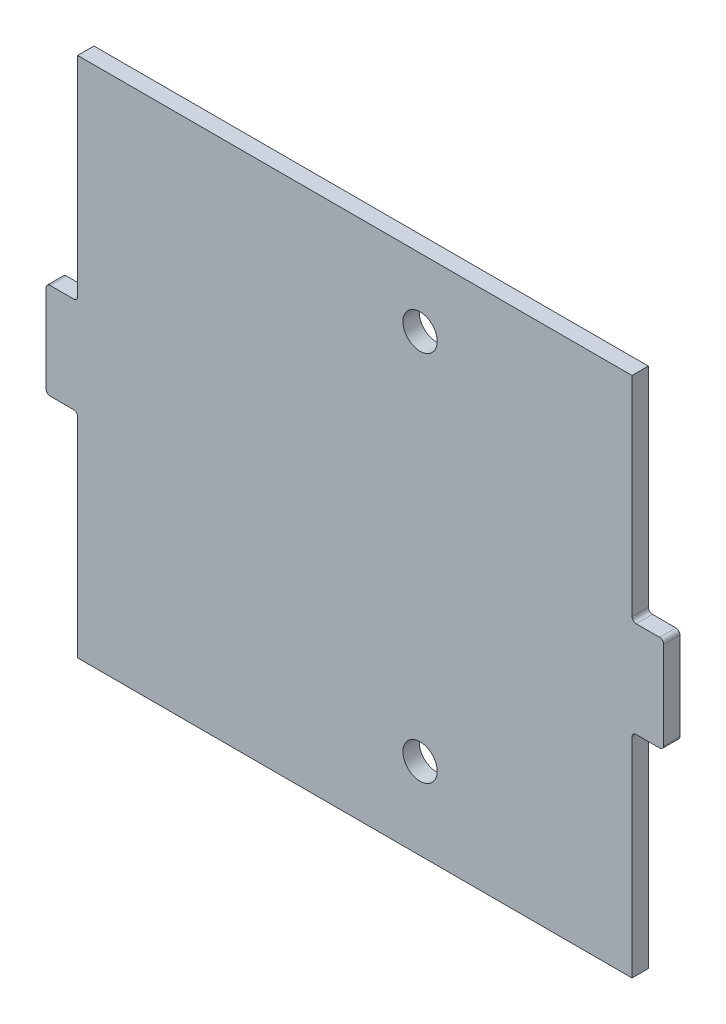
ISO-10303-21;
HEADER;
FILE_DESCRIPTION(('STEP AP214'),'2;1');
FILE_NAME('part.step','',(''),(''),'','','');
FILE_SCHEMA(('AUTOMOTIVE_DESIGN { 1 0 10303 214 1 1 1 1 }'));
ENDSEC;
DATA;
#1=APPLICATION_CONTEXT('core data for automotive mechanical design processes');
#2=APPLICATION_PROTOCOL_DEFINITION('international standard','automotive_design',2000,#1);
#3=PRODUCT_CONTEXT('',#1,'mechanical');
#4=PRODUCT('Part','Part','',(#3));
#5=PRODUCT_RELATED_PRODUCT_CATEGORY('part','',(#4));
#6=PRODUCT_DEFINITION_FORMATION('','',#4);
#7=PRODUCT_DEFINITION_CONTEXT('part definition',#1,'design');
#8=PRODUCT_DEFINITION('design','',#6,#7);
#9=PRODUCT_DEFINITION_SHAPE('','',#8);
#10=(LENGTH_UNIT() NAMED_UNIT(*) SI_UNIT(.MILLI.,.METRE.));
#11=(NAMED_UNIT(*) PLANE_ANGLE_UNIT() SI_UNIT($,.RADIAN.));
#12=(NAMED_UNIT(*) SI_UNIT($,.STERADIAN.) SOLID_ANGLE_UNIT());
#13=UNCERTAINTY_MEASURE_WITH_UNIT(LENGTH_MEASURE(1.E-05),#10,'distance_accuracy_value','');
#14=(GEOMETRIC_REPRESENTATION_CONTEXT(3) GLOBAL_UNCERTAINTY_ASSIGNED_CONTEXT((#13)) GLOBAL_UNIT_ASSIGNED_CONTEXT((#10,
#11,#12)) REPRESENTATION_CONTEXT('',''));
#15=CARTESIAN_POINT('',(0.,0.,0.));
#16=DIRECTION('',(0.,0.,1.));
#17=DIRECTION('',(1.,0.,0.));
#18=AXIS2_PLACEMENT_3D('',#15,#16,#17);
#19=CARTESIAN_POINT('',(215.9,-38.1,6.35));
#20=DIRECTION('',(-1.,0.,0.));
#21=DIRECTION('',(0.,-1.,0.));
#22=AXIS2_PLACEMENT_3D('',#19,#20,#21);
#23=PLANE('',#22);
#24=DIRECTION('',(0.,1.,0.));
#25=VECTOR('',#24,1.);
#26=CARTESIAN_POINT('',(215.9,-38.1,-6.35));
#27=LINE('',#26,#25);
#28=CARTESIAN_POINT('',(215.9,-203.2,-6.35));
#29=VERTEX_POINT('',#28);
#30=CARTESIAN_POINT('',(215.9,-40.513,-6.35));
#31=VERTEX_POINT('',#30);
#32=EDGE_CURVE('E202',#29,#31,#27,.T.);
#33=ORIENTED_EDGE('',*,*,#32,.T.);
#34=DIRECTION('',(0.,0.,-1.));
#35=VECTOR('',#34,1.);
#36=CARTESIAN_POINT('',(215.9,-40.513,6.35));
#37=LINE('',#36,#35);
#38=CARTESIAN_POINT('',(215.9,-40.513,6.35));
#39=VERTEX_POINT('',#38);
#40=EDGE_CURVE('E359',#31,#39,#37,.F.);
#41=ORIENTED_EDGE('',*,*,#40,.T.);
#42=DIRECTION('',(0.,1.,0.));
#43=VECTOR('',#42,1.);
#44=CARTESIAN_POINT('',(215.9,-38.1,6.35));
#45=LINE('',#44,#43);
#46=CARTESIAN_POINT('',(215.9,-203.2,6.35));
#47=VERTEX_POINT('',#46);
#48=EDGE_CURVE('E205',#47,#39,#45,.T.);
#49=ORIENTED_EDGE('',*,*,#48,.F.);
#50=DIRECTION('',(0.,0.,-1.));
#51=VECTOR('',#50,1.);
#52=CARTESIAN_POINT('',(215.9,-203.2,6.35));
#53=LINE('',#52,#51);
#54=EDGE_CURVE('E190',#47,#29,#53,.T.);
#55=ORIENTED_EDGE('',*,*,#54,.T.);
#56=EDGE_LOOP('',(#33,#41,#49,#55));
#57=FACE_BOUND('',#56,.T.);
#58=ADVANCED_FACE('F44',(#57),#23,.F.);
#59=CARTESIAN_POINT('',(215.9,-37.338,6.35));
#60=DIRECTION('',(0.,1.,0.));
#61=DIRECTION('',(-1.,0.,0.));
#62=AXIS2_PLACEMENT_3D('',#59,#60,#61);
#63=PLANE('',#62);
#64=DIRECTION('',(1.,0.,0.));
#65=VECTOR('',#64,1.);
#66=CARTESIAN_POINT('',(215.9,-37.338,-6.35));
#67=LINE('',#66,#65);
#68=CARTESIAN_POINT('',(219.075,-37.338,-6.35));
#69=VERTEX_POINT('',#68);
#70=CARTESIAN_POINT('',(237.363,-37.338,-6.35));
#71=VERTEX_POINT('',#70);
#72=EDGE_CURVE('E207',#69,#71,#67,.T.);
#73=ORIENTED_EDGE('',*,*,#72,.T.);
#74=DIRECTION('',(0.,0.,-1.));
#75=VECTOR('',#74,1.);
#76=CARTESIAN_POINT('',(237.363,-37.338,6.35));
#77=LINE('',#76,#75);
#78=CARTESIAN_POINT('',(237.363,-37.338,6.35));
#79=VERTEX_POINT('',#78);
#80=EDGE_CURVE('E356',#71,#79,#77,.F.);
#81=ORIENTED_EDGE('',*,*,#80,.T.);
#82=DIRECTION('',(1.,0.,0.));
#83=VECTOR('',#82,1.);
#84=CARTESIAN_POINT('',(215.9,-37.338,6.35));
#85=LINE('',#84,#83);
#86=CARTESIAN_POINT('',(219.075,-37.338,6.35));
#87=VERTEX_POINT('',#86);
#88=EDGE_CURVE('E239',#87,#79,#85,.T.);
#89=ORIENTED_EDGE('',*,*,#88,.F.);
#90=DIRECTION('',(0.,0.,-1.));
#91=VECTOR('',#90,1.);
#92=CARTESIAN_POINT('',(219.075,-37.338,-6.35));
#93=LINE('',#92,#91);
#94=EDGE_CURVE('E352',#87,#69,#93,.T.);
#95=ORIENTED_EDGE('',*,*,#94,.T.);
#96=EDGE_LOOP('',(#73,#81,#89,#95));
#97=FACE_BOUND('',#96,.T.);
#98=ADVANCED_FACE('F460',(#97),#63,.F.);
#99=CARTESIAN_POINT('',(240.538,38.1,6.35));
#100=DIRECTION('',(-1.,0.,0.));
#101=DIRECTION('',(0.,0.,1.));
#102=AXIS2_PLACEMENT_3D('',#99,#100,#101);
#103=PLANE('',#102);
#104=DIRECTION('',(0.,1.,0.));
#105=VECTOR('',#104,1.);
#106=CARTESIAN_POINT('',(240.538,38.1,-6.35));
#107=LINE('',#106,#105);
#108=CARTESIAN_POINT('',(240.538,-34.163,-6.35));
#109=VERTEX_POINT('',#108);
#110=CARTESIAN_POINT('',(240.538,34.163,-6.35));
#111=VERTEX_POINT('',#110);
#112=EDGE_CURVE('E241',#109,#111,#107,.T.);
#113=ORIENTED_EDGE('',*,*,#112,.T.);
#114=DIRECTION('',(0.,0.,-1.));
#115=VECTOR('',#114,1.);
#116=CARTESIAN_POINT('',(240.538,34.163,6.35));
#117=LINE('',#116,#115);
#118=CARTESIAN_POINT('',(240.538,34.163,6.35));
#119=VERTEX_POINT('',#118);
#120=EDGE_CURVE('E349',#111,#119,#117,.F.);
#121=ORIENTED_EDGE('',*,*,#120,.T.);
#122=DIRECTION('',(0.,1.,0.));
#123=VECTOR('',#122,1.);
#124=CARTESIAN_POINT('',(240.538,38.1,6.35));
#125=LINE('',#124,#123);
#126=CARTESIAN_POINT('',(240.538,-34.163,6.35));
#127=VERTEX_POINT('',#126);
#128=EDGE_CURVE('E252',#127,#119,#125,.T.);
#129=ORIENTED_EDGE('',*,*,#128,.F.);
#130=DIRECTION('',(0.,0.,-1.));
#131=VECTOR('',#130,1.);
#132=CARTESIAN_POINT('',(240.538,-34.163,6.35));
#133=LINE('',#132,#131);
#134=EDGE_CURVE('E345',#127,#109,#133,.T.);
#135=ORIENTED_EDGE('',*,*,#134,.T.);
#136=EDGE_LOOP('',(#113,#121,#129,#135));
#137=FACE_BOUND('',#136,.T.);
#138=ADVANCED_FACE('F469',(#137),#103,.F.);
#139=CARTESIAN_POINT('',(215.9,37.338,6.35));
#140=DIRECTION('',(0.,-1.,0.));
#141=DIRECTION('',(0.,0.,-1.));
#142=AXIS2_PLACEMENT_3D('',#139,#140,#141);
#143=PLANE('',#142);
#144=DIRECTION('',(-1.,0.,0.));
#145=VECTOR('',#144,1.);
#146=CARTESIAN_POINT('',(215.9,37.338,-6.35));
#147=LINE('',#146,#145);
#148=CARTESIAN_POINT('',(237.363,37.338,-6.35));
#149=VERTEX_POINT('',#148);
#150=CARTESIAN_POINT('',(219.075,37.338,-6.35));
#151=VERTEX_POINT('',#150);
#152=EDGE_CURVE('E245',#149,#151,#147,.T.);
#153=ORIENTED_EDGE('',*,*,#152,.T.);
#154=DIRECTION('',(0.,0.,-1.));
#155=VECTOR('',#154,1.);
#156=CARTESIAN_POINT('',(219.075,37.338,6.35));
#157=LINE('',#156,#155);
#158=CARTESIAN_POINT('',(219.075,37.338,6.35));
#159=VERTEX_POINT('',#158);
#160=EDGE_CURVE('E342',#151,#159,#157,.F.);
#161=ORIENTED_EDGE('',*,*,#160,.T.);
#162=DIRECTION('',(-1.,0.,0.));
#163=VECTOR('',#162,1.);
#164=CARTESIAN_POINT('',(215.9,37.338,6.35));
#165=LINE('',#164,#163);
#166=CARTESIAN_POINT('',(237.363,37.338,6.35));
#167=VERTEX_POINT('',#166);
#168=EDGE_CURVE('E236',#167,#159,#165,.T.);
#169=ORIENTED_EDGE('',*,*,#168,.F.);
#170=DIRECTION('',(0.,0.,-1.));
#171=VECTOR('',#170,1.);
#172=CARTESIAN_POINT('',(237.363,37.338,6.35));
#173=LINE('',#172,#171);
#174=EDGE_CURVE('E338',#167,#149,#173,.T.);
#175=ORIENTED_EDGE('',*,*,#174,.T.);
#176=EDGE_LOOP('',(#153,#161,#169,#175));
#177=FACE_BOUND('',#176,.T.);
#178=ADVANCED_FACE('F478',(#177),#143,.F.);
#179=CARTESIAN_POINT('',(215.9,203.2,6.35));
#180=DIRECTION('',(-1.,0.,0.));
#181=DIRECTION('',(0.,-1.,0.));
#182=AXIS2_PLACEMENT_3D('',#179,#180,#181);
#183=PLANE('',#182);
#184=DIRECTION('',(0.,1.,0.));
#185=VECTOR('',#184,1.);
#186=CARTESIAN_POINT('',(215.9,203.2,6.35));
#187=LINE('',#186,#185);
#188=CARTESIAN_POINT('',(215.9,40.513,6.35));
#189=VERTEX_POINT('',#188);
#190=CARTESIAN_POINT('',(215.9,203.2,6.35));
#191=VERTEX_POINT('',#190);
#192=EDGE_CURVE('E233',#189,#191,#187,.T.);
#193=ORIENTED_EDGE('',*,*,#192,.F.);
#194=DIRECTION('',(0.,0.,-1.));
#195=VECTOR('',#194,1.);
#196=CARTESIAN_POINT('',(215.9,40.513,-6.35));
#197=LINE('',#196,#195);
#198=CARTESIAN_POINT('',(215.9,40.513,-6.35));
#199=VERTEX_POINT('',#198);
#200=EDGE_CURVE('E334',#189,#199,#197,.T.);
#201=ORIENTED_EDGE('',*,*,#200,.T.);
#202=DIRECTION('',(0.,1.,0.));
#203=VECTOR('',#202,1.);
#204=CARTESIAN_POINT('',(215.9,203.2,-6.35));
#205=LINE('',#204,#203);
#206=CARTESIAN_POINT('',(215.9,203.2,-6.35));
#207=VERTEX_POINT('',#206);
#208=EDGE_CURVE('E216',#199,#207,#205,.T.);
#209=ORIENTED_EDGE('',*,*,#208,.T.);
#210=DIRECTION('',(0.,0.,-1.));
#211=VECTOR('',#210,1.);
#212=CARTESIAN_POINT('',(215.9,203.2,6.35));
#213=LINE('',#212,#211);
#214=EDGE_CURVE('E401',#191,#207,#213,.T.);
#215=ORIENTED_EDGE('',*,*,#214,.F.);
#216=EDGE_LOOP('',(#193,#201,#209,#215));
#217=FACE_BOUND('',#216,.T.);
#218=ADVANCED_FACE('F415',(#217),#183,.F.);
#219=CARTESIAN_POINT('',(-215.9,203.2,6.35));
#220=DIRECTION('',(0.,-1.,0.));
#221=DIRECTION('',(0.,0.,-1.));
#222=AXIS2_PLACEMENT_3D('',#219,#220,#221);
#223=PLANE('',#222);
#224=DIRECTION('',(-1.,0.,0.));
#225=VECTOR('',#224,1.);
#226=CARTESIAN_POINT('',(-215.9,203.2,-6.35));
#227=LINE('',#226,#225);
#228=CARTESIAN_POINT('',(-215.9,203.2,-6.35));
#229=VERTEX_POINT('',#228);
#230=EDGE_CURVE('E402',#207,#229,#227,.T.);
#231=ORIENTED_EDGE('',*,*,#230,.T.);
#232=DIRECTION('',(0.,0.,-1.));
#233=VECTOR('',#232,1.);
#234=CARTESIAN_POINT('',(-215.9,203.2,6.35));
#235=LINE('',#234,#233);
#236=CARTESIAN_POINT('',(-215.9,203.2,6.35));
#237=VERTEX_POINT('',#236);
#238=EDGE_CURVE('E266',#237,#229,#235,.T.);
#239=ORIENTED_EDGE('',*,*,#238,.F.);
#240=DIRECTION('',(-1.,0.,0.));
#241=VECTOR('',#240,1.);
#242=CARTESIAN_POINT('',(-215.9,203.2,6.35));
#243=LINE('',#242,#241);
#244=EDGE_CURVE('E230',#191,#237,#243,.T.);
#245=ORIENTED_EDGE('',*,*,#244,.F.);
#246=ORIENTED_EDGE('',*,*,#214,.T.);
#247=EDGE_LOOP('',(#231,#239,#245,#246));
#248=FACE_BOUND('',#247,.T.);
#249=ADVANCED_FACE('F418',(#248),#223,.F.);
#250=CARTESIAN_POINT('',(-215.9,203.2,6.35));
#251=DIRECTION('',(1.,0.,0.));
#252=DIRECTION('',(0.,0.,-1.));
#253=AXIS2_PLACEMENT_3D('',#250,#251,#252);
#254=PLANE('',#253);
#255=DIRECTION('',(0.,-1.,0.));
#256=VECTOR('',#255,1.);
#257=CARTESIAN_POINT('',(-215.9,203.2,-6.35));
#258=LINE('',#257,#256);
#259=CARTESIAN_POINT('',(-215.9,40.513,-6.35));
#260=VERTEX_POINT('',#259);
#261=EDGE_CURVE('E398',#229,#260,#258,.T.);
#262=ORIENTED_EDGE('',*,*,#261,.T.);
#263=DIRECTION('',(0.,0.,-1.));
#264=VECTOR('',#263,1.);
#265=CARTESIAN_POINT('',(-215.9,40.513,6.35));
#266=LINE('',#265,#264);
#267=CARTESIAN_POINT('',(-215.9,40.513,6.35));
#268=VERTEX_POINT('',#267);
#269=EDGE_CURVE('E331',#260,#268,#266,.F.);
#270=ORIENTED_EDGE('',*,*,#269,.T.);
#271=DIRECTION('',(0.,-1.,0.));
#272=VECTOR('',#271,1.);
#273=CARTESIAN_POINT('',(-215.9,203.2,6.35));
#274=LINE('',#273,#272);
#275=EDGE_CURVE('E226',#237,#268,#274,.T.);
#276=ORIENTED_EDGE('',*,*,#275,.F.);
#277=ORIENTED_EDGE('',*,*,#238,.T.);
#278=EDGE_LOOP('',(#262,#270,#276,#277));
#279=FACE_BOUND('',#278,.T.);
#280=ADVANCED_FACE('F423',(#279),#254,.F.);
#281=CARTESIAN_POINT('',(-215.9,37.338,6.35));
#282=DIRECTION('',(0.,-1.,0.));
#283=DIRECTION('',(1.,0.,0.));
#284=AXIS2_PLACEMENT_3D('',#281,#282,#283);
#285=PLANE('',#284);
#286=DIRECTION('',(-1.,0.,0.));
#287=VECTOR('',#286,1.);
#288=CARTESIAN_POINT('',(-215.9,37.338,-6.35));
#289=LINE('',#288,#287);
#290=CARTESIAN_POINT('',(-219.075,37.338,-6.35));
#291=VERTEX_POINT('',#290);
#292=CARTESIAN_POINT('',(-237.363,37.338,-6.35));
#293=VERTEX_POINT('',#292);
#294=EDGE_CURVE('E262',#291,#293,#289,.T.);
#295=ORIENTED_EDGE('',*,*,#294,.T.);
#296=DIRECTION('',(0.,0.,-1.));
#297=VECTOR('',#296,1.);
#298=CARTESIAN_POINT('',(-237.363,37.338,6.35));
#299=LINE('',#298,#297);
#300=CARTESIAN_POINT('',(-237.363,37.338,6.35));
#301=VERTEX_POINT('',#300);
#302=EDGE_CURVE('E62',#293,#301,#299,.F.);
#303=ORIENTED_EDGE('',*,*,#302,.T.);
#304=DIRECTION('',(-1.,0.,0.));
#305=VECTOR('',#304,1.);
#306=CARTESIAN_POINT('',(-215.9,37.338,6.35));
#307=LINE('',#306,#305);
#308=CARTESIAN_POINT('',(-219.075,37.338,6.35));
#309=VERTEX_POINT('',#308);
#310=EDGE_CURVE('E229',#309,#301,#307,.T.);
#311=ORIENTED_EDGE('',*,*,#310,.F.);
#312=DIRECTION('',(0.,0.,-1.));
#313=VECTOR('',#312,1.);
#314=CARTESIAN_POINT('',(-219.075,37.338,-6.35));
#315=LINE('',#314,#313);
#316=EDGE_CURVE('E325',#309,#291,#315,.T.);
#317=ORIENTED_EDGE('',*,*,#316,.T.);
#318=EDGE_LOOP('',(#295,#303,#311,#317));
#319=FACE_BOUND('',#318,.T.);
#320=ADVANCED_FACE('F428',(#319),#285,.F.);
#321=CARTESIAN_POINT('',(-240.538,38.1,6.35));
#322=DIRECTION('',(1.,0.,0.));
#323=DIRECTION('',(0.,0.,-1.));
#324=AXIS2_PLACEMENT_3D('',#321,#322,#323);
#325=PLANE('',#324);
#326=DIRECTION('',(0.,-1.,0.));
#327=VECTOR('',#326,1.);
#328=CARTESIAN_POINT('',(-240.538,38.1,-6.35));
#329=LINE('',#328,#327);
#330=CARTESIAN_POINT('',(-240.538,34.163,-6.35));
#331=VERTEX_POINT('',#330);
#332=CARTESIAN_POINT('',(-240.538,-34.163,-6.35));
#333=VERTEX_POINT('',#332);
#334=EDGE_CURVE('E265',#331,#333,#329,.T.);
#335=ORIENTED_EDGE('',*,*,#334,.T.);
#336=DIRECTION('',(0.,0.,-1.));
#337=VECTOR('',#336,1.);
#338=CARTESIAN_POINT('',(-240.538,-34.163,6.35));
#339=LINE('',#338,#337);
#340=CARTESIAN_POINT('',(-240.538,-34.163,6.35));
#341=VERTEX_POINT('',#340);
#342=EDGE_CURVE('E310',#333,#341,#339,.F.);
#343=ORIENTED_EDGE('',*,*,#342,.T.);
#344=DIRECTION('',(0.,-1.,0.));
#345=VECTOR('',#344,1.);
#346=CARTESIAN_POINT('',(-240.538,38.1,6.35));
#347=LINE('',#346,#345);
#348=CARTESIAN_POINT('',(-240.538,34.163,6.35));
#349=VERTEX_POINT('',#348);
#350=EDGE_CURVE('E269',#349,#341,#347,.T.);
#351=ORIENTED_EDGE('',*,*,#350,.F.);
#352=DIRECTION('',(0.,0.,-1.));
#353=VECTOR('',#352,1.);
#354=CARTESIAN_POINT('',(-240.538,34.163,6.35));
#355=LINE('',#354,#353);
#356=EDGE_CURVE('E306',#349,#331,#355,.T.);
#357=ORIENTED_EDGE('',*,*,#356,.T.);
#358=EDGE_LOOP('',(#335,#343,#351,#357));
#359=FACE_BOUND('',#358,.T.);
#360=ADVANCED_FACE('F436',(#359),#325,.F.);
#361=CARTESIAN_POINT('',(-215.9,-37.338,6.35));
#362=DIRECTION('',(0.,1.,0.));
#363=DIRECTION('',(-1.,0.,0.));
#364=AXIS2_PLACEMENT_3D('',#361,#362,#363);
#365=PLANE('',#364);
#366=DIRECTION('',(1.,0.,0.));
#367=VECTOR('',#366,1.);
#368=CARTESIAN_POINT('',(-215.9,-37.338,-6.35));
#369=LINE('',#368,#367);
#370=CARTESIAN_POINT('',(-237.363,-37.338,-6.35));
#371=VERTEX_POINT('',#370);
#372=CARTESIAN_POINT('',(-219.075,-37.338,-6.35));
#373=VERTEX_POINT('',#372);
#374=EDGE_CURVE('E276',#371,#373,#369,.T.);
#375=ORIENTED_EDGE('',*,*,#374,.T.);
#376=DIRECTION('',(0.,0.,-1.));
#377=VECTOR('',#376,1.);
#378=CARTESIAN_POINT('',(-219.075,-37.338,6.35));
#379=LINE('',#378,#377);
#380=CARTESIAN_POINT('',(-219.075,-37.338,6.35));
#381=VERTEX_POINT('',#380);
#382=EDGE_CURVE('E291',#373,#381,#379,.F.);
#383=ORIENTED_EDGE('',*,*,#382,.T.);
#384=DIRECTION('',(1.,0.,0.));
#385=VECTOR('',#384,1.);
#386=CARTESIAN_POINT('',(-215.9,-37.338,6.35));
#387=LINE('',#386,#385);
#388=CARTESIAN_POINT('',(-237.363,-37.338,6.35));
#389=VERTEX_POINT('',#388);
#390=EDGE_CURVE('E225',#389,#381,#387,.T.);
#391=ORIENTED_EDGE('',*,*,#390,.F.);
#392=DIRECTION('',(0.,0.,-1.));
#393=VECTOR('',#392,1.);
#394=CARTESIAN_POINT('',(-237.363,-37.338,6.35));
#395=LINE('',#394,#393);
#396=EDGE_CURVE('E287',#389,#371,#395,.T.);
#397=ORIENTED_EDGE('',*,*,#396,.T.);
#398=EDGE_LOOP('',(#375,#383,#391,#397));
#399=FACE_BOUND('',#398,.T.);
#400=ADVANCED_FACE('F445',(#399),#365,.F.);
#401=CARTESIAN_POINT('',(-215.9,-38.1,6.35));
#402=DIRECTION('',(1.,0.,0.));
#403=DIRECTION('',(0.,1.,0.));
#404=AXIS2_PLACEMENT_3D('',#401,#402,#403);
#405=PLANE('',#404);
#406=DIRECTION('',(0.,-1.,0.));
#407=VECTOR('',#406,1.);
#408=CARTESIAN_POINT('',(-215.9,-38.1,6.35));
#409=LINE('',#408,#407);
#410=CARTESIAN_POINT('',(-215.9,-40.513,6.35));
#411=VERTEX_POINT('',#410);
#412=CARTESIAN_POINT('',(-215.9,-203.2,6.35));
#413=VERTEX_POINT('',#412);
#414=EDGE_CURVE('E222',#411,#413,#409,.T.);
#415=ORIENTED_EDGE('',*,*,#414,.F.);
#416=DIRECTION('',(0.,0.,-1.));
#417=VECTOR('',#416,1.);
#418=CARTESIAN_POINT('',(-215.9,-40.513,-6.35));
#419=LINE('',#418,#417);
#420=CARTESIAN_POINT('',(-215.9,-40.513,-6.35));
#421=VERTEX_POINT('',#420);
#422=EDGE_CURVE('E283',#411,#421,#419,.T.);
#423=ORIENTED_EDGE('',*,*,#422,.T.);
#424=DIRECTION('',(0.,-1.,0.));
#425=VECTOR('',#424,1.);
#426=CARTESIAN_POINT('',(-215.9,-38.1,-6.35));
#427=LINE('',#426,#425);
#428=CARTESIAN_POINT('',(-215.9,-203.2,-6.35));
#429=VERTEX_POINT('',#428);
#430=EDGE_CURVE('E198',#421,#429,#427,.T.);
#431=ORIENTED_EDGE('',*,*,#430,.T.);
#432=DIRECTION('',(0.,0.,-1.));
#433=VECTOR('',#432,1.);
#434=CARTESIAN_POINT('',(-215.9,-203.2,6.35));
#435=LINE('',#434,#433);
#436=EDGE_CURVE('E193',#413,#429,#435,.T.);
#437=ORIENTED_EDGE('',*,*,#436,.F.);
#438=EDGE_LOOP('',(#415,#423,#431,#437));
#439=FACE_BOUND('',#438,.T.);
#440=ADVANCED_FACE('F453',(#439),#405,.F.);
#441=CARTESIAN_POINT('',(-215.9,-203.2,6.35));
#442=DIRECTION('',(0.,1.,0.));
#443=DIRECTION('',(0.,0.,1.));
#444=AXIS2_PLACEMENT_3D('',#441,#442,#443);
#445=PLANE('',#444);
#446=DIRECTION('',(1.,0.,0.));
#447=VECTOR('',#446,1.);
#448=CARTESIAN_POINT('',(-215.9,-203.2,-6.35));
#449=LINE('',#448,#447);
#450=EDGE_CURVE('E186',#429,#29,#449,.T.);
#451=ORIENTED_EDGE('',*,*,#450,.T.);
#452=ORIENTED_EDGE('',*,*,#54,.F.);
#453=DIRECTION('',(1.,0.,0.));
#454=VECTOR('',#453,1.);
#455=CARTESIAN_POINT('',(-215.9,-203.2,6.35));
#456=LINE('',#455,#454);
#457=EDGE_CURVE('E218',#413,#47,#456,.T.);
#458=ORIENTED_EDGE('',*,*,#457,.F.);
#459=ORIENTED_EDGE('',*,*,#436,.T.);
#460=EDGE_LOOP('',(#451,#452,#458,#459));
#461=FACE_BOUND('',#460,.T.);
#462=ADVANCED_FACE('F188',(#461),#445,.F.);
#463=CARTESIAN_POINT('',(0.,0.,6.35));
#464=DIRECTION('',(0.,0.,1.));
#465=DIRECTION('',(1.,0.,0.));
#466=AXIS2_PLACEMENT_3D('',#463,#464,#465);
#467=PLANE('',#466);
#468=CARTESIAN_POINT('',(50.8000000000004,150.299999999983,6.34999999999999));
#469=DIRECTION('',(0.,0.,1.));
#470=DIRECTION('',(1.,0.,0.));
#471=AXIS2_PLACEMENT_3D('',#468,#469,#470);
#472=CIRCLE('',#471,13.3350000000001);
#473=CARTESIAN_POINT('',(64.1350000000005,150.299999999983,6.34999999999999));
#474=VERTEX_POINT('',#473);
#475=EDGE_CURVE('E384',#474,#474,#472,.F.);
#476=ORIENTED_EDGE('',*,*,#475,.T.);
#477=EDGE_LOOP('',(#476));
#478=FACE_BOUND('',#477,.T.);
#479=CARTESIAN_POINT('',(50.8000000000004,-139.700000000005,6.34999999999999));
#480=DIRECTION('',(0.,0.,1.));
#481=DIRECTION('',(1.,0.,0.));
#482=AXIS2_PLACEMENT_3D('',#479,#480,#481);
#483=CIRCLE('',#482,13.3350000000001);
#484=CARTESIAN_POINT('',(64.1350000000005,-139.700000000005,6.34999999999999));
#485=VERTEX_POINT('',#484);
#486=EDGE_CURVE('E240',#485,#485,#483,.F.);
#487=ORIENTED_EDGE('',*,*,#486,.T.);
#488=EDGE_LOOP('',(#487));
#489=FACE_BOUND('',#488,.T.);
#490=ORIENTED_EDGE('',*,*,#350,.T.);
#491=CARTESIAN_POINT('',(-237.363,-34.163,6.35));
#492=DIRECTION('',(0.,0.,1.));
#493=DIRECTION('',(1.,0.,0.));
#494=AXIS2_PLACEMENT_3D('',#491,#492,#493);
#495=CIRCLE('',#494,3.175);
#496=EDGE_CURVE('E322',#341,#389,#495,.T.);
#497=ORIENTED_EDGE('',*,*,#496,.T.);
#498=ORIENTED_EDGE('',*,*,#390,.T.);
#499=CARTESIAN_POINT('',(-219.075,-40.513,6.35));
#500=DIRECTION('',(0.,0.,1.));
#501=DIRECTION('',(1.,0.,0.));
#502=AXIS2_PLACEMENT_3D('',#499,#500,#501);
#503=CIRCLE('',#502,3.175);
#504=EDGE_CURVE('E365',#381,#411,#503,.F.);
#505=ORIENTED_EDGE('',*,*,#504,.T.);
#506=ORIENTED_EDGE('',*,*,#414,.T.);
#507=ORIENTED_EDGE('',*,*,#457,.T.);
#508=ORIENTED_EDGE('',*,*,#48,.T.);
#509=CARTESIAN_POINT('',(219.075,-40.513,6.35));
#510=DIRECTION('',(0.,0.,1.));
#511=DIRECTION('',(1.,0.,0.));
#512=AXIS2_PLACEMENT_3D('',#509,#510,#511);
#513=CIRCLE('',#512,3.175);
#514=EDGE_CURVE('E12',#39,#87,#513,.F.);
#515=ORIENTED_EDGE('',*,*,#514,.T.);
#516=ORIENTED_EDGE('',*,*,#88,.T.);
#517=CARTESIAN_POINT('',(237.363,-34.163,6.35));
#518=DIRECTION('',(0.,0.,1.));
#519=DIRECTION('',(1.,0.,0.));
#520=AXIS2_PLACEMENT_3D('',#517,#518,#519);
#521=CIRCLE('',#520,3.175);
#522=EDGE_CURVE('E313',#79,#127,#521,.T.);
#523=ORIENTED_EDGE('',*,*,#522,.T.);
#524=ORIENTED_EDGE('',*,*,#128,.T.);
#525=CARTESIAN_POINT('',(237.363,34.163,6.35));
#526=DIRECTION('',(0.,0.,1.));
#527=DIRECTION('',(1.,0.,0.));
#528=AXIS2_PLACEMENT_3D('',#525,#526,#527);
#529=CIRCLE('',#528,3.175);
#530=EDGE_CURVE('E316',#119,#167,#529,.T.);
#531=ORIENTED_EDGE('',*,*,#530,.T.);
#532=ORIENTED_EDGE('',*,*,#168,.T.);
#533=CARTESIAN_POINT('',(219.075,40.513,6.35));
#534=DIRECTION('',(0.,0.,1.));
#535=DIRECTION('',(1.,0.,0.));
#536=AXIS2_PLACEMENT_3D('',#533,#534,#535);
#537=CIRCLE('',#536,3.175);
#538=EDGE_CURVE('E376',#159,#189,#537,.F.);
#539=ORIENTED_EDGE('',*,*,#538,.T.);
#540=ORIENTED_EDGE('',*,*,#192,.T.);
#541=ORIENTED_EDGE('',*,*,#244,.T.);
#542=ORIENTED_EDGE('',*,*,#275,.T.);
#543=CARTESIAN_POINT('',(-219.075,40.513,6.35));
#544=DIRECTION('',(0.,0.,1.));
#545=DIRECTION('',(1.,0.,0.));
#546=AXIS2_PLACEMENT_3D('',#543,#544,#545);
#547=CIRCLE('',#546,3.175);
#548=EDGE_CURVE('E69',#268,#309,#547,.F.);
#549=ORIENTED_EDGE('',*,*,#548,.T.);
#550=ORIENTED_EDGE('',*,*,#310,.T.);
#551=CARTESIAN_POINT('',(-237.363,34.163,6.35));
#552=DIRECTION('',(0.,0.,1.));
#553=DIRECTION('',(1.,0.,0.));
#554=AXIS2_PLACEMENT_3D('',#551,#552,#553);
#555=CIRCLE('',#554,3.175);
#556=EDGE_CURVE('E319',#301,#349,#555,.T.);
#557=ORIENTED_EDGE('',*,*,#556,.T.);
#558=EDGE_LOOP('',(#490,#497,#498,#505,#506,#507,#508,#515,#516,#523,#524,#531,#532,#539,#540,
#541,#542,#549,#550,#557));
#559=FACE_BOUND('',#558,.T.);
#560=ADVANCED_FACE('F439',(#478,#489,#559),#467,.T.);
#561=CARTESIAN_POINT('',(0.,0.,-6.35));
#562=DIRECTION('',(0.,0.,1.));
#563=DIRECTION('',(1.,0.,0.));
#564=AXIS2_PLACEMENT_3D('',#561,#562,#563);
#565=PLANE('',#564);
#566=CARTESIAN_POINT('',(50.8000000000004,150.299999999983,-6.35000000000002));
#567=DIRECTION('',(0.,0.,1.));
#568=DIRECTION('',(1.,0.,0.));
#569=AXIS2_PLACEMENT_3D('',#566,#567,#568);
#570=CIRCLE('',#569,13.3350000000001);
#571=CARTESIAN_POINT('',(64.1350000000005,150.299999999983,-6.35000000000002));
#572=VERTEX_POINT('',#571);
#573=EDGE_CURVE('E48',#572,#572,#570,.F.);
#574=ORIENTED_EDGE('',*,*,#573,.F.);
#575=EDGE_LOOP('',(#574));
#576=FACE_BOUND('',#575,.T.);
#577=CARTESIAN_POINT('',(50.8000000000004,-139.700000000005,-6.34999999999999));
#578=DIRECTION('',(0.,0.,1.));
#579=DIRECTION('',(1.,0.,0.));
#580=AXIS2_PLACEMENT_3D('',#577,#578,#579);
#581=CIRCLE('',#580,13.3350000000001);
#582=CARTESIAN_POINT('',(64.1350000000005,-139.700000000005,-6.34999999999999));
#583=VERTEX_POINT('',#582);
#584=EDGE_CURVE('E221',#583,#583,#581,.F.);
#585=ORIENTED_EDGE('',*,*,#584,.F.);
#586=EDGE_LOOP('',(#585));
#587=FACE_BOUND('',#586,.T.);
#588=ORIENTED_EDGE('',*,*,#374,.F.);
#589=CARTESIAN_POINT('',(-237.363,-34.163,-6.35));
#590=DIRECTION('',(0.,0.,1.));
#591=DIRECTION('',(1.,0.,0.));
#592=AXIS2_PLACEMENT_3D('',#589,#590,#591);
#593=CIRCLE('',#592,3.175);
#594=EDGE_CURVE('E303',#371,#333,#593,.F.);
#595=ORIENTED_EDGE('',*,*,#594,.T.);
#596=ORIENTED_EDGE('',*,*,#334,.F.);
#597=CARTESIAN_POINT('',(-237.363,34.163,-6.35));
#598=DIRECTION('',(0.,0.,1.));
#599=DIRECTION('',(1.,0.,0.));
#600=AXIS2_PLACEMENT_3D('',#597,#598,#599);
#601=CIRCLE('',#600,3.175);
#602=EDGE_CURVE('E300',#331,#293,#601,.F.);
#603=ORIENTED_EDGE('',*,*,#602,.T.);
#604=ORIENTED_EDGE('',*,*,#294,.F.);
#605=CARTESIAN_POINT('',(-219.075,40.513,-6.35));
#606=DIRECTION('',(0.,0.,1.));
#607=DIRECTION('',(1.,0.,0.));
#608=AXIS2_PLACEMENT_3D('',#605,#606,#607);
#609=CIRCLE('',#608,3.175);
#610=EDGE_CURVE('E368',#291,#260,#609,.T.);
#611=ORIENTED_EDGE('',*,*,#610,.T.);
#612=ORIENTED_EDGE('',*,*,#261,.F.);
#613=ORIENTED_EDGE('',*,*,#230,.F.);
#614=ORIENTED_EDGE('',*,*,#208,.F.);
#615=CARTESIAN_POINT('',(219.075,40.513,-6.35));
#616=DIRECTION('',(0.,0.,1.));
#617=DIRECTION('',(1.,0.,0.));
#618=AXIS2_PLACEMENT_3D('',#615,#616,#617);
#619=CIRCLE('',#618,3.175);
#620=EDGE_CURVE('E373',#199,#151,#619,.T.);
#621=ORIENTED_EDGE('',*,*,#620,.T.);
#622=ORIENTED_EDGE('',*,*,#152,.F.);
#623=CARTESIAN_POINT('',(237.363,34.163,-6.35));
#624=DIRECTION('',(0.,0.,1.));
#625=DIRECTION('',(1.,0.,0.));
#626=AXIS2_PLACEMENT_3D('',#623,#624,#625);
#627=CIRCLE('',#626,3.175);
#628=EDGE_CURVE('E297',#149,#111,#627,.F.);
#629=ORIENTED_EDGE('',*,*,#628,.T.);
#630=ORIENTED_EDGE('',*,*,#112,.F.);
#631=CARTESIAN_POINT('',(237.363,-34.163,-6.35));
#632=DIRECTION('',(0.,0.,1.));
#633=DIRECTION('',(1.,0.,0.));
#634=AXIS2_PLACEMENT_3D('',#631,#632,#633);
#635=CIRCLE('',#634,3.175);
#636=EDGE_CURVE('E294',#109,#71,#635,.F.);
#637=ORIENTED_EDGE('',*,*,#636,.T.);
#638=ORIENTED_EDGE('',*,*,#72,.F.);
#639=CARTESIAN_POINT('',(219.075,-40.513,-6.35));
#640=DIRECTION('',(0.,0.,1.));
#641=DIRECTION('',(1.,0.,0.));
#642=AXIS2_PLACEMENT_3D('',#639,#640,#641);
#643=CIRCLE('',#642,3.175);
#644=EDGE_CURVE('E54',#69,#31,#643,.T.);
#645=ORIENTED_EDGE('',*,*,#644,.T.);
#646=ORIENTED_EDGE('',*,*,#32,.F.);
#647=ORIENTED_EDGE('',*,*,#450,.F.);
#648=ORIENTED_EDGE('',*,*,#430,.F.);
#649=CARTESIAN_POINT('',(-219.075,-40.513,-6.35));
#650=DIRECTION('',(0.,0.,1.));
#651=DIRECTION('',(1.,0.,0.));
#652=AXIS2_PLACEMENT_3D('',#649,#650,#651);
#653=CIRCLE('',#652,3.175);
#654=EDGE_CURVE('E362',#421,#373,#653,.T.);
#655=ORIENTED_EDGE('',*,*,#654,.T.);
#656=EDGE_LOOP('',(#588,#595,#596,#603,#604,#611,#612,#613,#614,#621,#622,#629,#630,#637,#638,
#645,#646,#647,#648,#655));
#657=FACE_BOUND('',#656,.T.);
#658=ADVANCED_FACE('F210',(#576,#587,#657),#565,.F.);
#659=CARTESIAN_POINT('',(50.8000000000004,-139.700000000005,173.4));
#660=DIRECTION('',(0.,0.,-1.));
#661=DIRECTION('',(-1.,0.,0.));
#662=AXIS2_PLACEMENT_3D('',#659,#660,#661);
#663=CYLINDRICAL_SURFACE('',#662,13.3350000000001);
#664=ORIENTED_EDGE('',*,*,#486,.F.);
#665=EDGE_LOOP('',(#664));
#666=FACE_BOUND('',#665,.T.);
#667=ORIENTED_EDGE('',*,*,#584,.T.);
#668=EDGE_LOOP('',(#667));
#669=FACE_BOUND('',#668,.T.);
#670=ADVANCED_FACE('F511',(#666,#669),#663,.F.);
#671=CARTESIAN_POINT('',(50.8000000000004,150.299999999983,248.4));
#672=DIRECTION('',(0.,0.,-1.));
#673=DIRECTION('',(-1.,0.,0.));
#674=AXIS2_PLACEMENT_3D('',#671,#672,#673);
#675=CYLINDRICAL_SURFACE('',#674,13.3350000000001);
#676=ORIENTED_EDGE('',*,*,#475,.F.);
#677=EDGE_LOOP('',(#676));
#678=FACE_BOUND('',#677,.T.);
#679=ORIENTED_EDGE('',*,*,#573,.T.);
#680=EDGE_LOOP('',(#679));
#681=FACE_BOUND('',#680,.T.);
#682=ADVANCED_FACE('F46',(#678,#681),#675,.F.);
#683=CARTESIAN_POINT('',(-219.075,-40.513,6.35));
#684=DIRECTION('',(0.,0.,1.));
#685=DIRECTION('',(1.,0.,0.));
#686=AXIS2_PLACEMENT_3D('',#683,#684,#685);
#687=CYLINDRICAL_SURFACE('',#686,3.175);
#688=ORIENTED_EDGE('',*,*,#504,.F.);
#689=ORIENTED_EDGE('',*,*,#382,.F.);
#690=ORIENTED_EDGE('',*,*,#654,.F.);
#691=ORIENTED_EDGE('',*,*,#422,.F.);
#692=EDGE_LOOP('',(#688,#689,#690,#691));
#693=FACE_BOUND('',#692,.T.);
#694=ADVANCED_FACE('F450',(#693),#687,.F.);
#695=CARTESIAN_POINT('',(-237.363,-34.163,6.35));
#696=DIRECTION('',(0.,0.,-1.));
#697=DIRECTION('',(-1.,0.,0.));
#698=AXIS2_PLACEMENT_3D('',#695,#696,#697);
#699=CYLINDRICAL_SURFACE('',#698,3.175);
#700=ORIENTED_EDGE('',*,*,#496,.F.);
#701=ORIENTED_EDGE('',*,*,#342,.F.);
#702=ORIENTED_EDGE('',*,*,#594,.F.);
#703=ORIENTED_EDGE('',*,*,#396,.F.);
#704=EDGE_LOOP('',(#700,#701,#702,#703));
#705=FACE_BOUND('',#704,.T.);
#706=ADVANCED_FACE('F443',(#705),#699,.T.);
#707=CARTESIAN_POINT('',(-237.363,34.163,6.35));
#708=DIRECTION('',(0.,0.,-1.));
#709=DIRECTION('',(-1.,0.,0.));
#710=AXIS2_PLACEMENT_3D('',#707,#708,#709);
#711=CYLINDRICAL_SURFACE('',#710,3.175);
#712=ORIENTED_EDGE('',*,*,#556,.F.);
#713=ORIENTED_EDGE('',*,*,#302,.F.);
#714=ORIENTED_EDGE('',*,*,#602,.F.);
#715=ORIENTED_EDGE('',*,*,#356,.F.);
#716=EDGE_LOOP('',(#712,#713,#714,#715));
#717=FACE_BOUND('',#716,.T.);
#718=ADVANCED_FACE('F433',(#717),#711,.T.);
#719=CARTESIAN_POINT('',(-219.075,40.513,6.35));
#720=DIRECTION('',(0.,0.,1.));
#721=DIRECTION('',(1.,0.,0.));
#722=AXIS2_PLACEMENT_3D('',#719,#720,#721);
#723=CYLINDRICAL_SURFACE('',#722,3.175);
#724=ORIENTED_EDGE('',*,*,#548,.F.);
#725=ORIENTED_EDGE('',*,*,#269,.F.);
#726=ORIENTED_EDGE('',*,*,#610,.F.);
#727=ORIENTED_EDGE('',*,*,#316,.F.);
#728=EDGE_LOOP('',(#724,#725,#726,#727));
#729=FACE_BOUND('',#728,.T.);
#730=ADVANCED_FACE('F426',(#729),#723,.F.);
#731=CARTESIAN_POINT('',(219.075,40.513,6.35));
#732=DIRECTION('',(0.,0.,1.));
#733=DIRECTION('',(1.,0.,0.));
#734=AXIS2_PLACEMENT_3D('',#731,#732,#733);
#735=CYLINDRICAL_SURFACE('',#734,3.175);
#736=ORIENTED_EDGE('',*,*,#538,.F.);
#737=ORIENTED_EDGE('',*,*,#160,.F.);
#738=ORIENTED_EDGE('',*,*,#620,.F.);
#739=ORIENTED_EDGE('',*,*,#200,.F.);
#740=EDGE_LOOP('',(#736,#737,#738,#739));
#741=FACE_BOUND('',#740,.T.);
#742=ADVANCED_FACE('F482',(#741),#735,.F.);
#743=CARTESIAN_POINT('',(237.363,34.163,6.35));
#744=DIRECTION('',(0.,0.,-1.));
#745=DIRECTION('',(-1.,0.,0.));
#746=AXIS2_PLACEMENT_3D('',#743,#744,#745);
#747=CYLINDRICAL_SURFACE('',#746,3.175);
#748=ORIENTED_EDGE('',*,*,#530,.F.);
#749=ORIENTED_EDGE('',*,*,#120,.F.);
#750=ORIENTED_EDGE('',*,*,#628,.F.);
#751=ORIENTED_EDGE('',*,*,#174,.F.);
#752=EDGE_LOOP('',(#748,#749,#750,#751));
#753=FACE_BOUND('',#752,.T.);
#754=ADVANCED_FACE('F475',(#753),#747,.T.);
#755=CARTESIAN_POINT('',(237.363,-34.163,6.35));
#756=DIRECTION('',(0.,0.,-1.));
#757=DIRECTION('',(-1.,0.,0.));
#758=AXIS2_PLACEMENT_3D('',#755,#756,#757);
#759=CYLINDRICAL_SURFACE('',#758,3.175);
#760=ORIENTED_EDGE('',*,*,#522,.F.);
#761=ORIENTED_EDGE('',*,*,#80,.F.);
#762=ORIENTED_EDGE('',*,*,#636,.F.);
#763=ORIENTED_EDGE('',*,*,#134,.F.);
#764=EDGE_LOOP('',(#760,#761,#762,#763));
#765=FACE_BOUND('',#764,.T.);
#766=ADVANCED_FACE('F466',(#765),#759,.T.);
#767=CARTESIAN_POINT('',(219.075,-40.513,6.35));
#768=DIRECTION('',(0.,0.,1.));
#769=DIRECTION('',(1.,0.,0.));
#770=AXIS2_PLACEMENT_3D('',#767,#768,#769);
#771=CYLINDRICAL_SURFACE('',#770,3.175);
#772=ORIENTED_EDGE('',*,*,#514,.F.);
#773=ORIENTED_EDGE('',*,*,#40,.F.);
#774=ORIENTED_EDGE('',*,*,#644,.F.);
#775=ORIENTED_EDGE('',*,*,#94,.F.);
#776=EDGE_LOOP('',(#772,#773,#774,#775));
#777=FACE_BOUND('',#776,.T.);
#778=ADVANCED_FACE('F458',(#777),#771,.F.);
#779=CLOSED_SHELL('',(#58,#98,#138,#178,#218,#249,#280,#320,#360,#400,#440,#462,#560,#658,#670,
#682,#694,#706,#718,#730,#742,#754,#766,#778));
#780=MANIFOLD_SOLID_BREP('B2',#779);
#781=ADVANCED_BREP_SHAPE_REPRESENTATION('',(#18,#780),#14);
#782=SHAPE_DEFINITION_REPRESENTATION(#9,#781);
ENDSEC;
END-ISO-10303-21;
